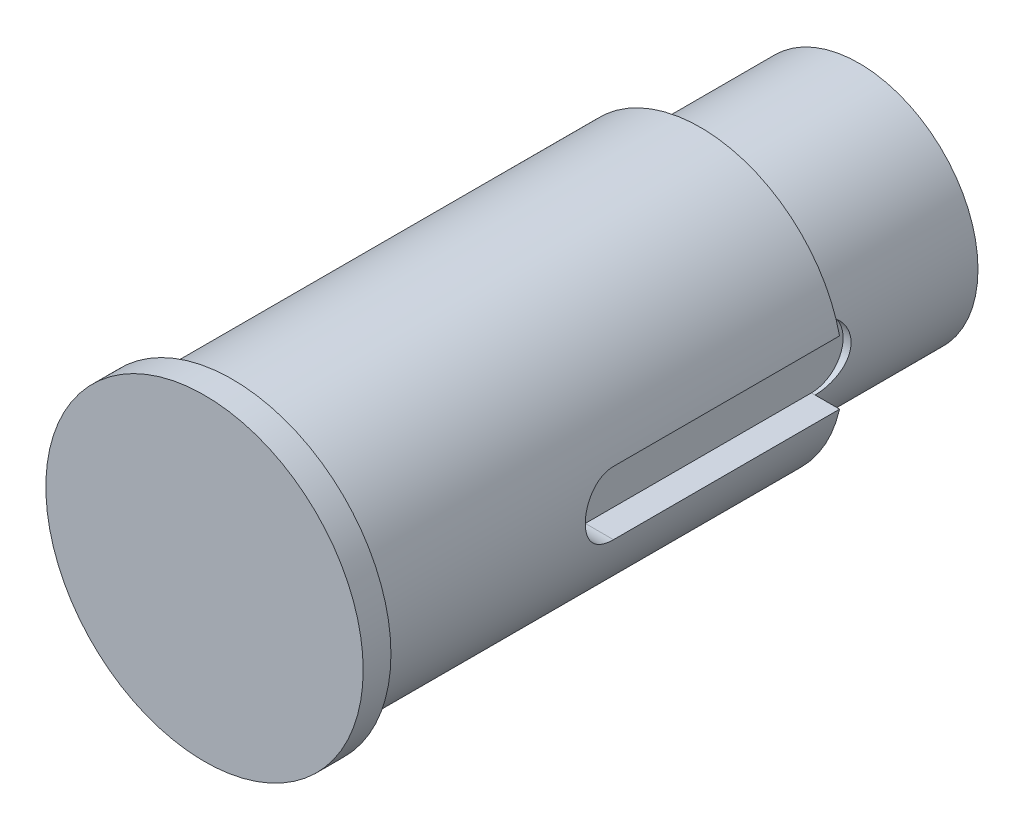
ISO-10303-21;
HEADER;
FILE_DESCRIPTION(('STEP AP214'),'2;1');
FILE_NAME('part.step','',(''),(''),'','','');
FILE_SCHEMA(('AUTOMOTIVE_DESIGN { 1 0 10303 214 1 1 1 1 }'));
ENDSEC;
DATA;
#1=APPLICATION_CONTEXT('core data for automotive mechanical design processes');
#2=APPLICATION_PROTOCOL_DEFINITION('international standard','automotive_design',2000,#1);
#3=PRODUCT_CONTEXT('',#1,'mechanical');
#4=PRODUCT('Part','Part','',(#3));
#5=PRODUCT_RELATED_PRODUCT_CATEGORY('part','',(#4));
#6=PRODUCT_DEFINITION_FORMATION('','',#4);
#7=PRODUCT_DEFINITION_CONTEXT('part definition',#1,'design');
#8=PRODUCT_DEFINITION('design','',#6,#7);
#9=PRODUCT_DEFINITION_SHAPE('','',#8);
#10=(LENGTH_UNIT() NAMED_UNIT(*) SI_UNIT(.MILLI.,.METRE.));
#11=(NAMED_UNIT(*) PLANE_ANGLE_UNIT() SI_UNIT($,.RADIAN.));
#12=(NAMED_UNIT(*) SI_UNIT($,.STERADIAN.) SOLID_ANGLE_UNIT());
#13=UNCERTAINTY_MEASURE_WITH_UNIT(LENGTH_MEASURE(1.E-05),#10,'distance_accuracy_value','');
#14=(GEOMETRIC_REPRESENTATION_CONTEXT(3) GLOBAL_UNCERTAINTY_ASSIGNED_CONTEXT((#13)) GLOBAL_UNIT_ASSIGNED_CONTEXT((#10,
#11,#12)) REPRESENTATION_CONTEXT('',''));
#15=CARTESIAN_POINT('',(0.,0.,0.));
#16=DIRECTION('',(0.,0.,1.));
#17=DIRECTION('',(1.,0.,0.));
#18=AXIS2_PLACEMENT_3D('',#15,#16,#17);
#19=CARTESIAN_POINT('',(29.,0.,-154.5));
#20=DIRECTION('',(0.,0.,-1.));
#21=DIRECTION('',(-1.,0.,0.));
#22=AXIS2_PLACEMENT_3D('',#19,#20,#21);
#23=PLANE('',#22);
#24=CARTESIAN_POINT('',(0.,0.,-154.5));
#25=DIRECTION('',(0.,0.,1.));
#26=DIRECTION('',(1.,0.,0.));
#27=AXIS2_PLACEMENT_3D('',#24,#25,#26);
#28=CIRCLE('',#27,20.);
#29=CARTESIAN_POINT('',(20.,0.,-154.5));
#30=VERTEX_POINT('',#29);
#31=EDGE_CURVE('E146',#30,#30,#28,.F.);
#32=ORIENTED_EDGE('',*,*,#31,.F.);
#33=EDGE_LOOP('',(#32));
#34=FACE_BOUND('',#33,.T.);
#35=ADVANCED_FACE('F17',(#34),#23,.F.);
#36=CARTESIAN_POINT('',(-15.,0.,-237.));
#37=DIRECTION('',(0.,0.,1.));
#38=DIRECTION('',(1.,0.,0.));
#39=AXIS2_PLACEMENT_3D('',#36,#37,#38);
#40=PLANE('',#39);
#41=CARTESIAN_POINT('',(0.,0.,-237.));
#42=DIRECTION('',(0.,0.,1.));
#43=DIRECTION('',(1.,0.,0.));
#44=AXIS2_PLACEMENT_3D('',#41,#42,#43);
#45=CIRCLE('',#44,15.);
#46=CARTESIAN_POINT('',(15.,0.,-237.));
#47=VERTEX_POINT('',#46);
#48=EDGE_CURVE('E127',#47,#47,#45,.T.);
#49=ORIENTED_EDGE('',*,*,#48,.F.);
#50=EDGE_LOOP('',(#49));
#51=FACE_BOUND('',#50,.T.);
#52=ADVANCED_FACE('F162',(#51),#40,.F.);
#53=CARTESIAN_POINT('',(14.,0.,-217.));
#54=DIRECTION('',(1.,0.,0.));
#55=DIRECTION('',(0.,0.,-1.));
#56=AXIS2_PLACEMENT_3D('',#53,#54,#55);
#57=PLANE('',#56);
#58=CARTESIAN_POINT('',(14.,0.,-217.));
#59=DIRECTION('',(1.,0.,0.));
#60=DIRECTION('',(0.,0.,-1.));
#61=AXIS2_PLACEMENT_3D('',#58,#59,#60);
#62=CIRCLE('',#61,4.);
#63=CARTESIAN_POINT('',(14.,-4.,-217.));
#64=VERTEX_POINT('',#63);
#65=CARTESIAN_POINT('',(14.,4.,-217.));
#66=VERTEX_POINT('',#65);
#67=EDGE_CURVE('E81',#64,#66,#62,.T.);
#68=ORIENTED_EDGE('',*,*,#67,.T.);
#69=DIRECTION('',(0.,0.,1.));
#70=VECTOR('',#69,1.);
#71=CARTESIAN_POINT('',(14.,4.,-217.));
#72=LINE('',#71,#70);
#73=CARTESIAN_POINT('',(14.,4.,-188.5));
#74=VERTEX_POINT('',#73);
#75=EDGE_CURVE('E91',#66,#74,#72,.T.);
#76=ORIENTED_EDGE('',*,*,#75,.T.);
#77=CARTESIAN_POINT('',(14.,0.,-188.5));
#78=DIRECTION('',(1.,0.,0.));
#79=DIRECTION('',(0.,0.,-1.));
#80=AXIS2_PLACEMENT_3D('',#77,#78,#79);
#81=CIRCLE('',#80,4.);
#82=CARTESIAN_POINT('',(14.,-4.,-188.5));
#83=VERTEX_POINT('',#82);
#84=EDGE_CURVE('E97',#74,#83,#81,.T.);
#85=ORIENTED_EDGE('',*,*,#84,.T.);
#86=DIRECTION('',(0.,0.,-1.));
#87=VECTOR('',#86,1.);
#88=CARTESIAN_POINT('',(14.,-4.,-217.));
#89=LINE('',#88,#87);
#90=EDGE_CURVE('E101',#83,#64,#89,.T.);
#91=ORIENTED_EDGE('',*,*,#90,.T.);
#92=EDGE_LOOP('',(#68,#76,#85,#91));
#93=FACE_BOUND('',#92,.T.);
#94=ADVANCED_FACE('F99',(#93),#57,.T.);
#95=CARTESIAN_POINT('',(14.,0.,-217.));
#96=DIRECTION('',(1.,0.,0.));
#97=DIRECTION('',(0.,0.,-1.));
#98=AXIS2_PLACEMENT_3D('',#95,#96,#97);
#99=CYLINDRICAL_SURFACE('',#98,4.);
#100=DIRECTION('',(1.,0.,0.));
#101=VECTOR('',#100,1.);
#102=CARTESIAN_POINT('',(14.,4.,-217.));
#103=LINE('',#102,#101);
#104=CARTESIAN_POINT('',(14.456832294801,4.,-217.));
#105=VERTEX_POINT('',#104);
#106=EDGE_CURVE('E77',#66,#105,#103,.T.);
#107=ORIENTED_EDGE('',*,*,#106,.F.);
#108=ORIENTED_EDGE('',*,*,#67,.F.);
#109=DIRECTION('',(1.,0.,0.));
#110=VECTOR('',#109,1.);
#111=CARTESIAN_POINT('',(14.,-4.,-217.));
#112=LINE('',#111,#110);
#113=CARTESIAN_POINT('',(14.456832294801,-4.,-217.));
#114=VERTEX_POINT('',#113);
#115=EDGE_CURVE('E41',#64,#114,#112,.T.);
#116=ORIENTED_EDGE('',*,*,#115,.T.);
#117=CARTESIAN_POINT('',(14.456832294801,4.,-217.));
#118=CARTESIAN_POINT('',(14.4568189842467,4.00001309389173,-217.110358243404));
#119=CARTESIAN_POINT('',(14.4580956467717,3.99543311151602,-217.220708521993));
#120=CARTESIAN_POINT('',(14.4631301353517,3.97718874589724,-217.440578653966));
#121=CARTESIAN_POINT('',(14.4668875005959,3.96352604983923,-217.55009865776));
#122=CARTESIAN_POINT('',(14.4767740441058,3.9272569574126,-217.767301653514));
#123=CARTESIAN_POINT('',(14.482898107258,3.90466984692441,-217.874988087848));
#124=CARTESIAN_POINT('',(14.4973231400467,3.8507654383818,-218.087974860356));
#125=CARTESIAN_POINT('',(14.5056241479174,3.81944798699436,-218.193275156586));
#126=CARTESIAN_POINT('',(14.5334412456827,3.71275643853688,-218.504463418776));
#127=CARTESIAN_POINT('',(14.5558829598252,3.6246033260793,-218.705874933548));
#128=CARTESIAN_POINT('',(14.6060171290377,3.41695780475813,-219.091020759626));
#129=CARTESIAN_POINT('',(14.6337113178035,3.29745504324303,-219.274749203973));
#130=CARTESIAN_POINT('',(14.6920016406366,3.0273032087801,-219.623970576928));
#131=CARTESIAN_POINT('',(14.7226489452442,2.87601544465619,-219.788961840966));
#132=CARTESIAN_POINT('',(14.7829523618628,2.54795832924028,-220.091557566962));
#133=CARTESIAN_POINT('',(14.8126083123117,2.37118484921247,-220.229157582868));
#134=CARTESIAN_POINT('',(14.8681604116921,1.99367199592153,-220.475172130185));
#135=CARTESIAN_POINT('',(14.8939887414057,1.79259414843392,-220.583083965578));
#136=CARTESIAN_POINT('',(14.9383834129136,1.37435575552787,-220.763372888961));
#137=CARTESIAN_POINT('',(14.9569513215518,1.15719869214845,-220.835757644777));
#138=CARTESIAN_POINT('',(14.9843709217852,0.718234307369659,-220.941309825169));
#139=CARTESIAN_POINT('',(14.9934353394137,0.496647293428081,-220.975337212894));
#140=CARTESIAN_POINT('',(15.0015705103632,0.0507319917605545,-221.005914313223));
#141=CARTESIAN_POINT('',(15.0006427191926,-0.173595891963463,-221.002469484192));
#142=CARTESIAN_POINT('',(14.9890534931376,-0.612629502642196,-220.958804313632));
#143=CARTESIAN_POINT('',(14.9786381919443,-0.827435206418381,-220.919513872344));
#144=CARTESIAN_POINT('',(14.9495347795912,-1.24728467665109,-220.806774849137));
#145=CARTESIAN_POINT('',(14.9308462762364,-1.45232797980576,-220.733324647849));
#146=CARTESIAN_POINT('',(14.8869312076945,-1.84920963545355,-220.553640033747));
#147=CARTESIAN_POINT('',(14.8616414267933,-2.0408962646662,-220.44708662777));
#148=CARTESIAN_POINT('',(14.8072486052897,-2.40398441957152,-220.204457231035));
#149=CARTESIAN_POINT('',(14.7781448982353,-2.57538239000353,-220.068376077817));
#150=CARTESIAN_POINT('',(14.7182294237972,-2.89854935036784,-219.765672028899));
#151=CARTESIAN_POINT('',(14.6873926412643,-3.04955722400814,-219.598241992106));
#152=CARTESIAN_POINT('',(14.6282716207252,-3.32161448391785,-219.239957159291));
#153=CARTESIAN_POINT('',(14.5999880903709,-3.44265558078016,-219.049095903519));
#154=CARTESIAN_POINT('',(14.5618587427771,-3.59932937334136,-218.748646716635));
#155=CARTESIAN_POINT('',(14.5498268172621,-3.64754371945354,-218.645711084959));
#156=CARTESIAN_POINT('',(14.5275984074125,-3.73509417643335,-218.435953678728));
#157=CARTESIAN_POINT('',(14.5174011851057,-3.7744338585787,-218.329133487537));
#158=CARTESIAN_POINT('',(14.4991713081511,-3.84386783810504,-218.11248058078));
#159=CARTESIAN_POINT('',(14.4911364080612,-3.87397173088608,-218.002651121807));
#160=CARTESIAN_POINT('',(14.4774747012191,-3.92471856960777,-217.780724778875));
#161=CARTESIAN_POINT('',(14.4718467722231,-3.94536592495321,-217.66862897718));
#162=CARTESIAN_POINT('',(14.4639761334309,-3.97411378733403,-217.463748975282));
#163=CARTESIAN_POINT('',(14.4613012625133,-3.98382319960777,-217.371203553833));
#164=CARTESIAN_POINT('',(14.4577275048596,-3.99676420153357,-217.18577464669));
#165=CARTESIAN_POINT('',(14.4568258092259,-4.00000603663185,-217.092891929568));
#166=CARTESIAN_POINT('',(14.456832294801,-4.,-217.));
#167=B_SPLINE_CURVE_WITH_KNOTS('',3,(#117,#118,#119,#120,#121,#122,#123,#124,#125,#126,#127,
#128,#129,#130,#131,#132,#133,#134,#135,#136,#137,#138,#139,#140,#141,#142,#143,#144,#145,#146,
#147,#148,#149,#150,#151,#152,#153,#154,#155,#156,#157,#158,#159,#160,#161,#162,#163,#164,#165,
#166),.UNSPECIFIED.,.F.,.F.,(4,2,2,2,2,2,2,2,2,2,2,2,2,2,2,2,2,2,2,2,2,2,2,2,4),(0.,
0.330958670878107,0.661855880768595,0.992041890688739,1.32223370010844,1.98190700187192,
2.64179842357638,3.31649637536149,3.99130375261116,4.67691814590527,5.36238449759359,
6.03215661862348,6.70183117906694,7.35461236515051,8.00742449996366,8.66673340793706,
9.32615767867952,10.005759878567,10.6855498604335,11.0281077435253,11.3705275300854,
11.7125903499583,12.0544935096115,12.3335333037378,12.6121307120356),.UNSPECIFIED.);
#168=EDGE_CURVE('E30',#105,#114,#167,.T.);
#169=ORIENTED_EDGE('',*,*,#168,.F.);
#170=EDGE_LOOP('',(#107,#108,#116,#169));
#171=FACE_BOUND('',#170,.T.);
#172=ADVANCED_FACE('F79',(#171),#99,.F.);
#173=CARTESIAN_POINT('',(0.,0.,21.9632069157836));
#174=DIRECTION('',(0.,0.,1.));
#175=DIRECTION('',(1.,0.,0.));
#176=AXIS2_PLACEMENT_3D('',#173,#174,#175);
#177=CYLINDRICAL_SURFACE('',#176,15.);
#178=CARTESIAN_POINT('',(0.,0.,-217.));
#179=DIRECTION('',(0.,0.,1.));
#180=DIRECTION('',(1.,0.,0.));
#181=AXIS2_PLACEMENT_3D('',#178,#179,#180);
#182=CIRCLE('',#181,15.);
#183=EDGE_CURVE('E131',#105,#114,#182,.T.);
#184=ORIENTED_EDGE('',*,*,#183,.F.);
#185=ORIENTED_EDGE('',*,*,#168,.T.);
#186=EDGE_LOOP('',(#184,#185));
#187=FACE_BOUND('',#186,.T.);
#188=ORIENTED_EDGE('',*,*,#48,.T.);
#189=EDGE_LOOP('',(#188));
#190=FACE_BOUND('',#189,.T.);
#191=ADVANCED_FACE('F155',(#187,#190),#177,.T.);
#192=CARTESIAN_POINT('',(14.,4.,-217.));
#193=DIRECTION('',(0.,1.,0.));
#194=DIRECTION('',(0.,0.,1.));
#195=AXIS2_PLACEMENT_3D('',#192,#193,#194);
#196=PLANE('',#195);
#197=DIRECTION('',(1.,0.,0.));
#198=VECTOR('',#197,1.);
#199=CARTESIAN_POINT('',(14.,4.,-188.5));
#200=LINE('',#199,#198);
#201=CARTESIAN_POINT('',(17.5499287747842,4.,-188.5));
#202=VERTEX_POINT('',#201);
#203=EDGE_CURVE('E87',#74,#202,#200,.T.);
#204=ORIENTED_EDGE('',*,*,#203,.F.);
#205=ORIENTED_EDGE('',*,*,#75,.F.);
#206=ORIENTED_EDGE('',*,*,#106,.T.);
#207=CARTESIAN_POINT('',(17.5499287747842,4.,-217.));
#208=VERTEX_POINT('',#207);
#209=EDGE_CURVE('E88',#105,#208,#103,.T.);
#210=ORIENTED_EDGE('',*,*,#209,.T.);
#211=DIRECTION('',(0.,0.,1.));
#212=VECTOR('',#211,1.);
#213=CARTESIAN_POINT('',(17.5499287747842,4.,21.9632069157836));
#214=LINE('',#213,#212);
#215=EDGE_CURVE('E114',#202,#208,#214,.F.);
#216=ORIENTED_EDGE('',*,*,#215,.F.);
#217=EDGE_LOOP('',(#204,#205,#206,#210,#216));
#218=FACE_BOUND('',#217,.T.);
#219=ADVANCED_FACE('F92',(#218),#196,.F.);
#220=CARTESIAN_POINT('',(14.,0.,-188.5));
#221=DIRECTION('',(1.,0.,0.));
#222=DIRECTION('',(0.,0.,-1.));
#223=AXIS2_PLACEMENT_3D('',#220,#221,#222);
#224=CYLINDRICAL_SURFACE('',#223,4.);
#225=DIRECTION('',(1.,0.,0.));
#226=VECTOR('',#225,1.);
#227=CARTESIAN_POINT('',(14.,-4.,-188.5));
#228=LINE('',#227,#226);
#229=CARTESIAN_POINT('',(17.5499287747842,-4.,-188.5));
#230=VERTEX_POINT('',#229);
#231=EDGE_CURVE('E116',#83,#230,#228,.T.);
#232=ORIENTED_EDGE('',*,*,#231,.F.);
#233=ORIENTED_EDGE('',*,*,#84,.F.);
#234=ORIENTED_EDGE('',*,*,#203,.T.);
#235=CARTESIAN_POINT('',(17.5499287747842,-4.,-188.5));
#236=CARTESIAN_POINT('',(17.5499179482118,-4.00001238937464,-188.388981412255));
#237=CARTESIAN_POINT('',(17.5509819695589,-3.99537823856639,-188.277969881984));
#238=CARTESIAN_POINT('',(17.5551794879292,-3.97691300935655,-188.056769067217));
#239=CARTESIAN_POINT('',(17.5583126908548,-3.96308323794874,-187.946579668119));
#240=CARTESIAN_POINT('',(17.5665613350854,-3.92635430384776,-187.72798632528));
#241=CARTESIAN_POINT('',(17.5716733771688,-3.90347069223131,-187.619579650309));
#242=CARTESIAN_POINT('',(17.5837197448242,-3.84884086267842,-187.405156935385));
#243=CARTESIAN_POINT('',(17.590654085093,-3.81709457326495,-187.299140914719));
#244=CARTESIAN_POINT('',(17.6139050590484,-3.7088906765488,-186.985784001586));
#245=CARTESIAN_POINT('',(17.6326774330314,-3.6194354498416,-186.782941903276));
#246=CARTESIAN_POINT('',(17.6746378891729,-3.40861440144922,-186.395210988494));
#247=CARTESIAN_POINT('',(17.6978267333188,-3.28724307180187,-186.210325278418));
#248=CARTESIAN_POINT('',(17.7464568741276,-3.0137697598934,-185.860450853649));
#249=CARTESIAN_POINT('',(17.7719275565595,-2.86121984021379,-185.695815694849));
#250=CARTESIAN_POINT('',(17.8219962254935,-2.53068054684357,-185.394242662289));
#251=CARTESIAN_POINT('',(17.8465940747512,-2.35268719435789,-185.25730912856));
#252=CARTESIAN_POINT('',(17.8924664441068,-1.97392305233518,-185.013615945514));
#253=CARTESIAN_POINT('',(17.91370197651,-1.77292591543932,-184.907200093903));
#254=CARTESIAN_POINT('',(17.9501212916273,-1.35536125644536,-184.729796485247));
#255=CARTESIAN_POINT('',(17.9653060920056,-1.13879635990525,-184.658802770096));
#256=CARTESIAN_POINT('',(17.9877055606067,-0.699944099066334,-184.55537376637));
#257=CARTESIAN_POINT('',(17.9950449325155,-0.477805546818843,-184.522334534928));
#258=CARTESIAN_POINT('',(18.001359000618,-0.0310204428567904,-184.49386335615));
#259=CARTESIAN_POINT('',(18.0003344927609,0.193625868174877,-184.498427830256));
#260=CARTESIAN_POINT('',(17.9901309694474,0.634872705501661,-184.54458749404));
#261=CARTESIAN_POINT('',(17.9810955286189,0.851545246514032,-184.585530719172));
#262=CARTESIAN_POINT('',(17.9560494080144,1.27486341847507,-184.702246113026));
#263=CARTESIAN_POINT('',(17.9400384621777,1.48150866662711,-184.778019610254));
#264=CARTESIAN_POINT('',(17.9026105410964,1.8807101422684,-184.962814628609));
#265=CARTESIAN_POINT('',(17.8811537763162,2.07314859586625,-185.072082148573));
#266=CARTESIAN_POINT('',(17.8351845954862,2.43719211660422,-185.320586570349));
#267=CARTESIAN_POINT('',(17.8106718377239,2.60879484971175,-185.459826824893));
#268=CARTESIAN_POINT('',(17.7606669336214,2.9301465390565,-185.767812175208));
#269=CARTESIAN_POINT('',(17.7351650513842,3.07935044491591,-185.937123933811));
#270=CARTESIAN_POINT('',(17.6865301278222,3.34743029482724,-186.298792808738));
#271=CARTESIAN_POINT('',(17.6633977360572,3.46629793590133,-186.491156213128));
#272=CARTESIAN_POINT('',(17.6324485933559,3.61931766424102,-186.793130393925));
#273=CARTESIAN_POINT('',(17.6227384657345,3.6661920172394,-186.896288975465));
#274=CARTESIAN_POINT('',(17.6048698854913,3.75105881106029,-187.106313792326));
#275=CARTESIAN_POINT('',(17.5967108214101,3.78905475328375,-187.213178546875));
#276=CARTESIAN_POINT('',(17.5822009408796,3.85582374285981,-187.429740042135));
#277=CARTESIAN_POINT('',(17.5758482497402,3.88460635592099,-187.539433716989));
#278=CARTESIAN_POINT('',(17.565136331641,3.93275909885184,-187.760920039378));
#279=CARTESIAN_POINT('',(17.5607761628648,3.95213367594154,-187.872711669194));
#280=CARTESIAN_POINT('',(17.5549754973595,3.97780935445422,-188.070526177549));
#281=CARTESIAN_POINT('',(17.5530849751939,3.98613416785677,-188.156279105483));
#282=CARTESIAN_POINT('',(17.550560829103,3.9972267365964,-188.328018784478));
#283=CARTESIAN_POINT('',(17.5499251225624,4.00000369978313,-188.414004910522));
#284=CARTESIAN_POINT('',(17.5499287747842,4.,-188.5));
#285=B_SPLINE_CURVE_WITH_KNOTS('',3,(#235,#236,#237,#238,#239,#240,#241,#242,#243,#244,#245,
#246,#247,#248,#249,#250,#251,#252,#253,#254,#255,#256,#257,#258,#259,#260,#261,#262,#263,#264,
#265,#266,#267,#268,#269,#270,#271,#272,#273,#274,#275,#276,#277,#278,#279,#280,#281,#282,#283,
#284),.UNSPECIFIED.,.F.,.F.,(4,2,2,2,2,2,2,2,2,2,2,2,2,2,2,2,2,2,2,2,2,2,2,2,4),(0.,
0.332941725114866,0.665836138602793,0.998161230418318,1.33048900249576,1.99456616016475,
2.65875799709425,3.33326381755699,4.00787523156648,4.68981209998883,5.37163422595522,
6.04244979326467,6.71320152310677,7.37216948329736,8.03116258014025,8.6951166151614,
9.35914495831132,10.0373560373375,10.7157525428506,11.0565813464842,11.3972755088983,
11.7376147907015,12.0777930356355,12.3361428725903,12.5940635650623),.UNSPECIFIED.);
#286=EDGE_CURVE('E11',#230,#202,#285,.T.);
#287=ORIENTED_EDGE('',*,*,#286,.F.);
#288=EDGE_LOOP('',(#232,#233,#234,#287));
#289=FACE_BOUND('',#288,.T.);
#290=ADVANCED_FACE('F180',(#289),#224,.F.);
#291=CARTESIAN_POINT('',(14.,-4.,-217.));
#292=DIRECTION('',(0.,-1.,0.));
#293=DIRECTION('',(0.,0.,-1.));
#294=AXIS2_PLACEMENT_3D('',#291,#292,#293);
#295=PLANE('',#294);
#296=CARTESIAN_POINT('',(17.5499287747842,-4.,-217.));
#297=VERTEX_POINT('',#296);
#298=EDGE_CURVE('E115',#114,#297,#112,.T.);
#299=ORIENTED_EDGE('',*,*,#298,.F.);
#300=ORIENTED_EDGE('',*,*,#115,.F.);
#301=ORIENTED_EDGE('',*,*,#90,.F.);
#302=ORIENTED_EDGE('',*,*,#231,.T.);
#303=DIRECTION('',(0.,0.,1.));
#304=VECTOR('',#303,1.);
#305=CARTESIAN_POINT('',(17.5499287747842,-4.,21.9632069157836));
#306=LINE('',#305,#304);
#307=EDGE_CURVE('E124',#297,#230,#306,.T.);
#308=ORIENTED_EDGE('',*,*,#307,.F.);
#309=EDGE_LOOP('',(#299,#300,#301,#302,#308));
#310=FACE_BOUND('',#309,.T.);
#311=ADVANCED_FACE('F192',(#310),#295,.F.);
#312=CARTESIAN_POINT('',(-18.,0.,-217.));
#313=DIRECTION('',(0.,0.,1.));
#314=DIRECTION('',(1.,0.,0.));
#315=AXIS2_PLACEMENT_3D('',#312,#313,#314);
#316=PLANE('',#315);
#317=ORIENTED_EDGE('',*,*,#183,.T.);
#318=ORIENTED_EDGE('',*,*,#298,.T.);
#319=CARTESIAN_POINT('',(0.,0.,-217.));
#320=DIRECTION('',(0.,0.,1.));
#321=DIRECTION('',(1.,0.,0.));
#322=AXIS2_PLACEMENT_3D('',#319,#320,#321);
#323=CIRCLE('',#322,18.);
#324=EDGE_CURVE('E134',#208,#297,#323,.T.);
#325=ORIENTED_EDGE('',*,*,#324,.F.);
#326=ORIENTED_EDGE('',*,*,#209,.F.);
#327=EDGE_LOOP('',(#317,#318,#325,#326));
#328=FACE_BOUND('',#327,.T.);
#329=ADVANCED_FACE('F184',(#328),#316,.F.);
#330=CARTESIAN_POINT('',(0.,0.,21.9632069157836));
#331=DIRECTION('',(0.,0.,1.));
#332=DIRECTION('',(1.,0.,0.));
#333=AXIS2_PLACEMENT_3D('',#330,#331,#332);
#334=CYLINDRICAL_SURFACE('',#333,18.);
#335=CARTESIAN_POINT('',(0.,0.,-158.));
#336=DIRECTION('',(0.,0.,1.));
#337=DIRECTION('',(1.,0.,0.));
#338=AXIS2_PLACEMENT_3D('',#335,#336,#337);
#339=CIRCLE('',#338,18.);
#340=CARTESIAN_POINT('',(18.,0.,-158.));
#341=VERTEX_POINT('',#340);
#342=EDGE_CURVE('E138',#341,#341,#339,.T.);
#343=ORIENTED_EDGE('',*,*,#342,.F.);
#344=EDGE_LOOP('',(#343));
#345=FACE_BOUND('',#344,.T.);
#346=ORIENTED_EDGE('',*,*,#324,.T.);
#347=ORIENTED_EDGE('',*,*,#307,.T.);
#348=ORIENTED_EDGE('',*,*,#286,.T.);
#349=ORIENTED_EDGE('',*,*,#215,.T.);
#350=EDGE_LOOP('',(#346,#347,#348,#349));
#351=FACE_BOUND('',#350,.T.);
#352=ADVANCED_FACE('F190',(#345,#351),#334,.T.);
#353=CARTESIAN_POINT('',(-20.,0.,-158.));
#354=DIRECTION('',(0.,0.,1.));
#355=DIRECTION('',(1.,0.,0.));
#356=AXIS2_PLACEMENT_3D('',#353,#354,#355);
#357=PLANE('',#356);
#358=CARTESIAN_POINT('',(0.,0.,-158.));
#359=DIRECTION('',(0.,0.,1.));
#360=DIRECTION('',(1.,0.,0.));
#361=AXIS2_PLACEMENT_3D('',#358,#359,#360);
#362=CIRCLE('',#361,20.);
#363=CARTESIAN_POINT('',(20.,0.,-158.));
#364=VERTEX_POINT('',#363);
#365=EDGE_CURVE('E142',#364,#364,#362,.T.);
#366=ORIENTED_EDGE('',*,*,#365,.F.);
#367=EDGE_LOOP('',(#366));
#368=FACE_BOUND('',#367,.T.);
#369=ORIENTED_EDGE('',*,*,#342,.T.);
#370=EDGE_LOOP('',(#369));
#371=FACE_BOUND('',#370,.T.);
#372=ADVANCED_FACE('F205',(#368,#371),#357,.F.);
#373=CARTESIAN_POINT('',(0.,0.,21.9632069157836));
#374=DIRECTION('',(0.,0.,1.));
#375=DIRECTION('',(1.,0.,0.));
#376=AXIS2_PLACEMENT_3D('',#373,#374,#375);
#377=CYLINDRICAL_SURFACE('',#376,20.);
#378=ORIENTED_EDGE('',*,*,#31,.T.);
#379=EDGE_LOOP('',(#378));
#380=FACE_BOUND('',#379,.T.);
#381=ORIENTED_EDGE('',*,*,#365,.T.);
#382=EDGE_LOOP('',(#381));
#383=FACE_BOUND('',#382,.T.);
#384=ADVANCED_FACE('F172',(#380,#383),#377,.T.);
#385=CLOSED_SHELL('',(#35,#52,#94,#172,#191,#219,#290,#311,#329,#352,#372,#384));
#386=MANIFOLD_SOLID_BREP('B1',#385);
#387=ADVANCED_BREP_SHAPE_REPRESENTATION('',(#18,#386),#14);
#388=SHAPE_DEFINITION_REPRESENTATION(#9,#387);
ENDSEC;
END-ISO-10303-21;
